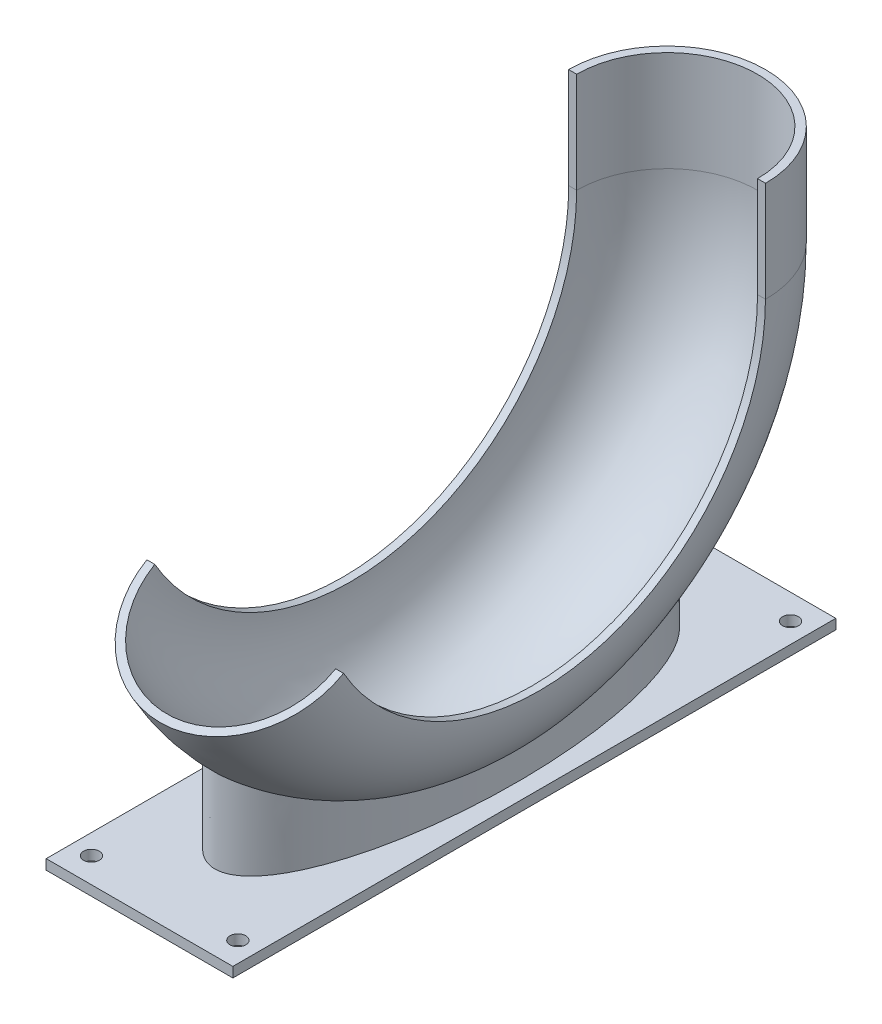
ISO-10303-21;
HEADER;
FILE_DESCRIPTION(('STEP AP214'),'2;1');
FILE_NAME('part.step','',(''),(''),'','','');
FILE_SCHEMA(('AUTOMOTIVE_DESIGN { 1 0 10303 214 1 1 1 1 }'));
ENDSEC;
DATA;
#1=APPLICATION_CONTEXT('core data for automotive mechanical design processes');
#2=APPLICATION_PROTOCOL_DEFINITION('international standard','automotive_design',2000,#1);
#3=PRODUCT_CONTEXT('',#1,'mechanical');
#4=PRODUCT('Part','Part','',(#3));
#5=PRODUCT_RELATED_PRODUCT_CATEGORY('part','',(#4));
#6=PRODUCT_DEFINITION_FORMATION('','',#4);
#7=PRODUCT_DEFINITION_CONTEXT('part definition',#1,'design');
#8=PRODUCT_DEFINITION('design','',#6,#7);
#9=PRODUCT_DEFINITION_SHAPE('','',#8);
#10=(LENGTH_UNIT() NAMED_UNIT(*) SI_UNIT(.MILLI.,.METRE.));
#11=(NAMED_UNIT(*) PLANE_ANGLE_UNIT() SI_UNIT($,.RADIAN.));
#12=(NAMED_UNIT(*) SI_UNIT($,.STERADIAN.) SOLID_ANGLE_UNIT());
#13=UNCERTAINTY_MEASURE_WITH_UNIT(LENGTH_MEASURE(1.E-05),#10,'distance_accuracy_value','');
#14=(GEOMETRIC_REPRESENTATION_CONTEXT(3) GLOBAL_UNCERTAINTY_ASSIGNED_CONTEXT((#13)) GLOBAL_UNIT_ASSIGNED_CONTEXT((#10,
#11,#12)) REPRESENTATION_CONTEXT('',''));
#15=CARTESIAN_POINT('',(0.,0.,0.));
#16=DIRECTION('',(0.,0.,1.));
#17=DIRECTION('',(1.,0.,0.));
#18=AXIS2_PLACEMENT_3D('',#15,#16,#17);
#19=CARTESIAN_POINT('',(0.,57.15,0.));
#20=DIRECTION('',(-1.,0.,0.));
#21=DIRECTION('',(0.,0.,1.));
#22=AXIS2_PLACEMENT_3D('',#19,#20,#21);
#23=TOROIDAL_SURFACE('',#22,57.15,24.86);
#24=CARTESIAN_POINT('',(24.86,57.15,0.));
#25=DIRECTION('',(-1.,0.,0.));
#26=DIRECTION('',(0.,0.,-1.));
#27=AXIS2_PLACEMENT_3D('',#24,#25,#26);
#28=CIRCLE('',#27,57.15);
#29=CARTESIAN_POINT('',(24.86,57.15,-57.15));
#30=VERTEX_POINT('',#29);
#31=CARTESIAN_POINT('',(24.86,28.5750000000003,49.4933518262809));
#32=VERTEX_POINT('',#31);
#33=EDGE_CURVE('E171',#30,#32,#28,.T.);
#34=ORIENTED_EDGE('',*,*,#33,.T.);
#35=CARTESIAN_POINT('',(0.,28.5750000000003,49.4933518262809));
#36=DIRECTION('',(0.,0.866025403784442,0.499999999999995));
#37=DIRECTION('',(1.,0.,0.));
#38=AXIS2_PLACEMENT_3D('',#35,#36,#37);
#39=CIRCLE('',#38,24.86);
#40=CARTESIAN_POINT('',(-24.86,28.5750000000003,49.4933518262809));
#41=VERTEX_POINT('',#40);
#42=EDGE_CURVE('E166',#41,#32,#39,.T.);
#43=ORIENTED_EDGE('',*,*,#42,.F.);
#44=CARTESIAN_POINT('',(-24.86,57.15,0.));
#45=DIRECTION('',(-1.,0.,0.));
#46=DIRECTION('',(0.,0.,-1.));
#47=AXIS2_PLACEMENT_3D('',#44,#45,#46);
#48=CIRCLE('',#47,57.15);
#49=CARTESIAN_POINT('',(-24.86,57.15,-57.15));
#50=VERTEX_POINT('',#49);
#51=EDGE_CURVE('E176',#50,#41,#48,.T.);
#52=ORIENTED_EDGE('',*,*,#51,.F.);
#53=CARTESIAN_POINT('',(0.,57.15,-57.15));
#54=DIRECTION('',(0.,-1.,0.));
#55=DIRECTION('',(1.,0.,0.));
#56=AXIS2_PLACEMENT_3D('',#53,#54,#55);
#57=CIRCLE('',#56,24.86);
#58=EDGE_CURVE('E148',#50,#30,#57,.T.);
#59=ORIENTED_EDGE('',*,*,#58,.T.);
#60=EDGE_LOOP('',(#34,#43,#52,#59));
#61=FACE_BOUND('',#60,.T.);
#62=CARTESIAN_POINT('',(0.,-1.66766401345772,57.15));
#63=CARTESIAN_POINT('',(-0.178848492996247,-1.66766454199373,57.1499992116019));
#64=CARTESIAN_POINT('',(-0.357703143540088,-1.67222600071906,57.1425284579619));
#65=CARTESIAN_POINT('',(-0.713726728572181,-1.69029072762417,57.1129102273241));
#66=CARTESIAN_POINT('',(-0.890895586579523,-1.70379439955008,57.0907620876338));
#67=CARTESIAN_POINT('',(-1.24228724068634,-1.73925621488908,57.0324966785866));
#68=CARTESIAN_POINT('',(-1.41650571125432,-1.76122580978427,56.9963604879065));
#69=CARTESIAN_POINT('',(-1.76058334092853,-1.81286516430904,56.9112198453707));
#70=CARTESIAN_POINT('',(-1.93044192838186,-1.84253592807919,56.8622137154186));
#71=CARTESIAN_POINT('',(-2.30935445547105,-1.91747503995724,56.7380745124606));
#72=CARTESIAN_POINT('',(-2.51686178400334,-1.96479310550471,56.6594592402112));
#73=CARTESIAN_POINT('',(-2.92285655427485,-2.06853997059414,56.4862983189966));
#74=CARTESIAN_POINT('',(-3.12133613940602,-2.12497651839542,56.3917391189725));
#75=CARTESIAN_POINT('',(-3.5092868827807,-2.24532663102402,56.1890346319803));
#76=CARTESIAN_POINT('',(-3.6987412322852,-2.30925343458834,56.0808652638758));
#77=CARTESIAN_POINT('',(-4.06843695057409,-2.44298663302802,55.8532669920397));
#78=CARTESIAN_POINT('',(-4.24868114212556,-2.51279120888075,55.7338415704181));
#79=CARTESIAN_POINT('',(-4.63519967451224,-2.67127828271343,55.4609992557792));
#80=CARTESIAN_POINT('',(-4.83960060812783,-2.76096948662821,55.3055226400686));
#81=CARTESIAN_POINT('',(-5.23711408042115,-2.94536447683028,54.9833002316253));
#82=CARTESIAN_POINT('',(-5.4302186060837,-3.04007173261331,54.8165466161666));
#83=CARTESIAN_POINT('',(-5.8060957453558,-3.23315021252265,54.4736927542222));
#84=CARTESIAN_POINT('',(-5.98886508174216,-3.33152258261191,54.2975895769908));
#85=CARTESIAN_POINT('',(-6.34532446564593,-3.53105946259726,53.9372071328339));
#86=CARTESIAN_POINT('',(-6.51899657666442,-3.63222892887993,53.7529129470627));
#87=CARTESIAN_POINT('',(-6.85771267580798,-3.83632706771237,53.3776839507408));
#88=CARTESIAN_POINT('',(-7.02276025346559,-3.93925498434131,53.1867519588434));
#89=CARTESIAN_POINT('',(-7.34507929889584,-4.14626666392499,52.7990873546648));
#90=CARTESIAN_POINT('',(-7.50235119925125,-4.25035036218495,52.6023550660447));
#91=CARTESIAN_POINT('',(-7.92118174357294,-4.53477764719471,52.0594822148204));
#92=CARTESIAN_POINT('',(-8.17579201920327,-4.71576688406498,51.7083075662338));
#93=CARTESIAN_POINT('',(-8.66700183032977,-5.07770627649855,50.9935942476309));
#94=CARTESIAN_POINT('',(-8.90359916248866,-5.25865642458977,50.6300540729108));
#95=CARTESIAN_POINT('',(-9.36075037473462,-5.61887527211132,49.8931140877776));
#96=CARTESIAN_POINT('',(-9.58132735077129,-5.7981460540035,49.519729573222));
#97=CARTESIAN_POINT('',(-10.0086848561781,-6.15429188914322,48.7639978832109));
#98=CARTESIAN_POINT('',(-10.2154639494059,-6.33116669148473,48.3816497803665));
#99=CARTESIAN_POINT('',(-10.587251408081,-6.65604121594503,47.6657969718773));
#100=CARTESIAN_POINT('',(-10.7539375597834,-6.80447051954047,47.3333551076422));
#101=CARTESIAN_POINT('',(-11.0790832561206,-7.09868004199863,46.6633090849058));
#102=CARTESIAN_POINT('',(-11.2375424681961,-7.2444601536179,46.3257047184326));
#103=CARTESIAN_POINT('',(-11.7016102336936,-7.67741713870339,45.3057635042271));
#104=CARTESIAN_POINT('',(-11.9958768514462,-7.96018230024556,44.6163609610707));
#105=CARTESIAN_POINT('',(-12.5584463393137,-8.51245397802807,43.221122941126));
#106=CARTESIAN_POINT('',(-12.826725969954,-8.78194852275139,42.5152734432971));
#107=CARTESIAN_POINT('',(-13.3400406710326,-9.30632761524536,41.0899128309377));
#108=CARTESIAN_POINT('',(-13.5850773307688,-9.56121316147144,40.3704026545347));
#109=CARTESIAN_POINT('',(-14.0535983092612,-10.0550038720308,38.9214196495707));
#110=CARTESIAN_POINT('',(-14.2771397896273,-10.2939508713863,38.1919794845824));
#111=CARTESIAN_POINT('',(-14.7052245597423,-10.7561977807733,36.7226463860196));
#112=CARTESIAN_POINT('',(-14.9097675867719,-10.9794974744161,35.9827533080603));
#113=CARTESIAN_POINT('',(-15.3011957251059,-11.4101199897453,34.4940898961341));
#114=CARTESIAN_POINT('',(-15.4880884844618,-11.6174497241396,33.7453235668099));
#115=CARTESIAN_POINT('',(-15.8454695495776,-12.0161620628193,32.2396911011265));
#116=CARTESIAN_POINT('',(-16.0159579425298,-12.2075447518655,31.482825007843));
#117=CARTESIAN_POINT('',(-16.3413724702058,-12.5742885464508,29.9624591983523));
#118=CARTESIAN_POINT('',(-16.4963088722672,-12.7496602153651,29.1989642251358));
#119=CARTESIAN_POINT('',(-16.7915300732545,-13.0846753484434,27.6657037295536));
#120=CARTESIAN_POINT('',(-16.9318141521606,-13.2443180396586,26.8959379010379));
#121=CARTESIAN_POINT('',(-17.3317047139908,-13.6999737889179,24.5783902892331));
#122=CARTESIAN_POINT('',(-17.5703577758538,-13.9727238856046,23.0223193995996));
#123=CARTESIAN_POINT('',(-17.9957153521242,-14.4584218159896,19.8948045695264));
#124=CARTESIAN_POINT('',(-18.1824449165322,-14.6713984872752,18.323368422025));
#125=CARTESIAN_POINT('',(-18.5070109066394,-15.0406658800455,15.1689143163945));
#126=CARTESIAN_POINT('',(-18.6448485597881,-15.1969580246184,13.5858966500423));
#127=CARTESIAN_POINT('',(-18.8736309974006,-15.455660897142,10.4125547218049));
#128=CARTESIAN_POINT('',(-18.9645876873864,-15.558085305056,8.82223241855312));
#129=CARTESIAN_POINT('',(-19.1009556144638,-15.7113734060408,5.63717378006652));
#130=CARTESIAN_POINT('',(-19.1463665073639,-15.7622367094626,4.04243741156576));
#131=CARTESIAN_POINT('',(-19.1922755192672,-15.8136567983408,0.851647624451846));
#132=CARTESIAN_POINT('',(-19.1927772517612,-15.8142176312457,-0.744405677863815));
#133=CARTESIAN_POINT('',(-19.1488839585887,-15.7650573085609,-3.9351340504986));
#134=CARTESIAN_POINT('',(-19.1044888428612,-15.7153360521075,-5.52980911804663));
#135=CARTESIAN_POINT('',(-18.9701719705509,-15.5643705796365,-8.71502841486653));
#136=CARTESIAN_POINT('',(-18.8802444711365,-15.4631198643899,-10.3055720976207));
#137=CARTESIAN_POINT('',(-18.6535829407047,-15.2068523691833,-13.4790042230832));
#138=CARTESIAN_POINT('',(-18.5168497367108,-15.0518365392139,-15.0618928005507));
#139=CARTESIAN_POINT('',(-18.1945269541103,-14.6851659239217,-18.2165964993304));
#140=CARTESIAN_POINT('',(-18.0089235474704,-14.4734951075471,-19.7884083569833));
#141=CARTESIAN_POINT('',(-17.5859817136604,-13.9905708285554,-22.9161185851811));
#142=CARTESIAN_POINT('',(-17.3486403606542,-13.719313996279,-24.4720160505386));
#143=CARTESIAN_POINT('',(-16.9507441938851,-13.2658700344011,-26.7899285949477));
#144=CARTESIAN_POINT('',(-16.8110766781152,-13.1069001116107,-27.5601703997124));
#145=CARTESIAN_POINT('',(-16.5171132111101,-12.7732304636608,-29.0944174356359));
#146=CARTESIAN_POINT('',(-16.3628179762702,-12.5985315088544,-29.8584229702289));
#147=CARTESIAN_POINT('',(-16.0388469757001,-12.233276528279,-31.3792359821021));
#148=CARTESIAN_POINT('',(-15.8691733603317,-12.0427227198016,-32.1360444494475));
#149=CARTESIAN_POINT('',(-15.5134884572883,-11.6456865035811,-33.6416104493916));
#150=CARTESIAN_POINT('',(-15.3274772314356,-11.4392041561126,-34.3903680124432));
#151=CARTESIAN_POINT('',(-14.9378419776514,-11.0102340446703,-35.8792625328428));
#152=CARTESIAN_POINT('',(-14.7342059717563,-10.7877354134423,-36.619393233476));
#153=CARTESIAN_POINT('',(-14.3080130413355,-10.3270761648411,-38.0892963840448));
#154=CARTESIAN_POINT('',(-14.0854557406073,-10.0889152360839,-38.8190686276917));
#155=CARTESIAN_POINT('',(-13.6194690472105,-9.59716785141629,-40.2673660319328));
#156=CARTESIAN_POINT('',(-13.3760235263274,-9.34356952067701,-40.9858819858333));
#157=CARTESIAN_POINT('',(-12.8661525222173,-8.82180736548068,-42.4093448327723));
#158=CARTESIAN_POINT('',(-12.5997283805227,-8.55364439167109,-43.1142925150151));
#159=CARTESIAN_POINT('',(-12.1158571937264,-8.0775628974423,-44.3214970752297));
#160=CARTESIAN_POINT('',(-11.9044376816514,-7.8727751944728,-44.82740978703));
#161=CARTESIAN_POINT('',(-11.4661546757256,-7.45654950916877,-45.8298266637003));
#162=CARTESIAN_POINT('',(-11.2392895099641,-7.24511080823564,-46.3263298025739));
#163=CARTESIAN_POINT('',(-10.7681541749241,-6.81632499263647,-47.3087628151123));
#164=CARTESIAN_POINT('',(-10.5238757682865,-6.59897511215113,-47.7946875408497));
#165=CARTESIAN_POINT('',(-10.0153494338106,-6.15935848636814,-48.7544999713334));
#166=CARTESIAN_POINT('',(-9.75108200060868,-5.93708709216571,-49.2283752998809));
#167=CARTESIAN_POINT('',(-9.3375765677821,-5.60143721567509,-49.9278588731856));
#168=CARTESIAN_POINT('',(-9.19691037531257,-5.48919506665562,-50.1591020971772));
#169=CARTESIAN_POINT('',(-8.90936977686869,-5.26422536309683,-50.6174490521814));
#170=CARTESIAN_POINT('',(-8.76249568832876,-5.15149783364103,-50.844552994004));
#171=CARTESIAN_POINT('',(-8.46209111120894,-4.92595912159254,-51.2940057475721));
#172=CARTESIAN_POINT('',(-8.30856543827043,-4.81314805577244,-51.5163578310209));
#173=CARTESIAN_POINT('',(-7.994130338046,-4.5877728950142,-51.9558883540252));
#174=CARTESIAN_POINT('',(-7.83322150044955,-4.47520878110198,-52.1730672046664));
#175=CARTESIAN_POINT('',(-7.50202630951432,-4.24997569093824,-52.6031744688897));
#176=CARTESIAN_POINT('',(-7.33167855866189,-4.13731228665977,-52.8160586613402));
#177=CARTESIAN_POINT('',(-6.98182695891139,-3.9133717799365,-53.2349858343503));
#178=CARTESIAN_POINT('',(-6.80232228436231,-3.80209480363108,-53.4410281952283));
#179=CARTESIAN_POINT('',(-6.43303586214994,-3.58169392163964,-53.845215786981));
#180=CARTESIAN_POINT('',(-6.24324750990621,-3.47257146253808,-54.0433557974053));
#181=CARTESIAN_POINT('',(-5.85342741390424,-3.25822604210502,-54.4290035162927));
#182=CARTESIAN_POINT('',(-5.65345854017554,-3.15298476212344,-54.6165642490601));
#183=CARTESIAN_POINT('',(-5.24116726435038,-2.94720513617125,-54.9801764850313));
#184=CARTESIAN_POINT('',(-5.02885109596688,-2.84666446249617,-55.1562337022335));
#185=CARTESIAN_POINT('',(-4.5906837597335,-2.65214301294522,-55.4941819970264));
#186=CARTESIAN_POINT('',(-4.36484885172046,-2.55815463957724,-55.6560895385723));
#187=CARTESIAN_POINT('',(-3.98312750743247,-2.41158739926033,-55.9067992470817));
#188=CARTESIAN_POINT('',(-3.8316497303757,-2.35637360203447,-56.0007844453441));
#189=CARTESIAN_POINT('',(-3.52244964401377,-2.25028551539733,-56.1806178482274));
#190=CARTESIAN_POINT('',(-3.36472777955307,-2.19941091766226,-56.2664666310334));
#191=CARTESIAN_POINT('',(-3.04291362653003,-2.10285013160159,-56.4288045828752));
#192=CARTESIAN_POINT('',(-2.87881961934888,-2.05716535623922,-56.505291203438));
#193=CARTESIAN_POINT('',(-2.54442910954423,-1.9719650824322,-56.6474804538514));
#194=CARTESIAN_POINT('',(-2.37413246150146,-1.93244972874297,-56.713182830669));
#195=CARTESIAN_POINT('',(-2.02548092666296,-1.86014062097355,-56.8330989264688));
#196=CARTESIAN_POINT('',(-1.84704912851576,-1.82744294748584,-56.8871487462481));
#197=CARTESIAN_POINT('',(-1.48514921406938,-1.77049280342599,-56.9811050533313));
#198=CARTESIAN_POINT('',(-1.30168131268732,-1.74623997307042,-57.0210121431722));
#199=CARTESIAN_POINT('',(-0.931345564623859,-1.70712326292789,-57.085300245974));
#200=CARTESIAN_POINT('',(-0.744483854286833,-1.69224389480241,-57.1097068718351));
#201=CARTESIAN_POINT('',(-0.368821708550303,-1.67243926588055,-57.1421797334333));
#202=CARTESIAN_POINT('',(-0.180021551260178,-1.66751259668413,-57.1502482811618));
#203=CARTESIAN_POINT('',(0.175375037472764,-1.66780449506217,-57.1497696586221));
#204=CARTESIAN_POINT('',(0.341978527999268,-1.67190094333084,-57.1430602824974));
#205=CARTESIAN_POINT('',(0.673785100018587,-1.6878643973035,-57.116889282399));
#206=CARTESIAN_POINT('',(0.838988312406551,-1.6997306684017,-57.0974288639855));
#207=CARTESIAN_POINT('',(1.16691524221668,-1.73085575784859,-57.0463057114767));
#208=CARTESIAN_POINT('',(1.32963674792725,-1.75012081062954,-57.0146326865881));
#209=CARTESIAN_POINT('',(1.6514779284684,-1.79545917791311,-56.9399374043604));
#210=CARTESIAN_POINT('',(1.81059704737282,-1.82153353556031,-56.8969134081104));
#211=CARTESIAN_POINT('',(2.17213745865251,-1.88864109608779,-56.7858947730082));
#212=CARTESIAN_POINT('',(2.37305613447687,-1.931812735004,-56.7142843255156));
#213=CARTESIAN_POINT('',(2.76660108698988,-2.02691932961269,-56.555863062327));
#214=CARTESIAN_POINT('',(2.95922450371388,-2.07885727779061,-56.4690470556471));
#215=CARTESIAN_POINT('',(3.52489221600959,-2.24566316819816,-56.1888580034658));
#216=CARTESIAN_POINT('',(3.88516312954303,-2.37140893744474,-55.9759310452963));
#217=CARTESIAN_POINT('',(4.43196512072702,-2.58611321043711,-55.6079198217304));
#218=CARTESIAN_POINT('',(4.62934550679482,-2.66911353801462,-55.4647424573683));
#219=CARTESIAN_POINT('',(5.01373302329529,-2.84015835795796,-55.1674902965457));
#220=CARTESIAN_POINT('',(5.2007329440338,-2.92820627191064,-55.0134080910671));
#221=CARTESIAN_POINT('',(5.5650620837994,-3.10803748807468,-54.6962231234377));
#222=CARTESIAN_POINT('',(5.74238834570585,-3.19982191768653,-54.533117633327));
#223=CARTESIAN_POINT('',(6.08853636075367,-3.38631559460669,-54.1989740131481));
#224=CARTESIAN_POINT('',(6.25734069602548,-3.48103024085922,-54.0279209079452));
#225=CARTESIAN_POINT('',(6.58679921600103,-3.6723928556851,-53.6793549735694));
#226=CARTESIAN_POINT('',(6.74745667482546,-3.76904002547704,-53.5018447894633));
#227=CARTESIAN_POINT('',(7.06140038758813,-3.9636831659995,-53.141180239481));
#228=CARTESIAN_POINT('',(7.21468702559904,-4.06167906610851,-52.9580261685095));
#229=CARTESIAN_POINT('',(7.62129442773059,-4.32859615653338,-52.4546082123158));
#230=CARTESIAN_POINT('',(7.86814985714536,-4.49834822870013,-52.1295520528186));
#231=CARTESIAN_POINT('',(8.34490244464788,-4.83847036967429,-51.4675815256951));
#232=CARTESIAN_POINT('',(8.57479763535071,-5.00884050777983,-51.1306657890348));
#233=CARTESIAN_POINT('',(9.01943128882524,-5.34861379408192,-50.4473729842979));
#234=CARTESIAN_POINT('',(9.23419177778378,-5.518018003363,-50.1010107276464));
#235=CARTESIAN_POINT('',(9.65067253862039,-5.85515535315964,-49.3997077266613));
#236=CARTESIAN_POINT('',(9.85239141501111,-6.0228883132281,-49.0447660698733));
#237=CARTESIAN_POINT('',(10.2173141798932,-6.33311496864393,-48.3765577511937));
#238=CARTESIAN_POINT('',(10.3820080692394,-6.47591765638406,-48.0642451429745));
#239=CARTESIAN_POINT('',(10.7034461855032,-6.75936471227439,-47.4345829511567));
#240=CARTESIAN_POINT('',(10.8601900756501,-6.90000898881619,-47.1172331549237));
#241=CARTESIAN_POINT('',(11.3195083405231,-7.31828494226217,-46.1582399173094));
#242=CARTESIAN_POINT('',(11.6111355025805,-7.59223064528053,-45.5097152196383));
#243=CARTESIAN_POINT('',(12.1694189818831,-8.12875284495887,-44.1966776230494));
#244=CARTESIAN_POINT('',(12.4360517651451,-8.39131850391163,-43.5321503819101));
#245=CARTESIAN_POINT('',(12.9470103288634,-8.90367104439499,-42.18981261636));
#246=CARTESIAN_POINT('',(13.1913377107319,-9.15345884274269,-41.5120030498018));
#247=CARTESIAN_POINT('',(13.6593262844303,-9.63881418483811,-40.1466863562905));
#248=CARTESIAN_POINT('',(13.8830441708344,-9.87442008165165,-39.4592122185473));
#249=CARTESIAN_POINT('',(14.3123692306954,-10.3316876187822,-38.0740522872478));
#250=CARTESIAN_POINT('',(14.5179761556806,-10.5533490677777,-37.3763663537449));
#251=CARTESIAN_POINT('',(14.9123884708512,-10.9823123430396,-35.9723230919266));
#252=CARTESIAN_POINT('',(15.1012024281816,-11.1896214792189,-35.2659703968156));
#253=CARTESIAN_POINT('',(15.4632890339714,-11.5898524593845,-33.8452651478194));
#254=CARTESIAN_POINT('',(15.6365617269324,-11.7827743445677,-33.1309126168477));
#255=CARTESIAN_POINT('',(15.9683932557395,-12.1540702517767,-31.6955981989215));
#256=CARTESIAN_POINT('',(16.1269621099678,-12.332454168983,-30.9746411854165));
#257=CARTESIAN_POINT('',(16.4302869178928,-12.6748785430268,-29.5264766066545));
#258=CARTESIAN_POINT('',(16.5750430029573,-12.8389191362766,-28.7992691009152));
#259=CARTESIAN_POINT('',(16.9896835097847,-13.3098098731352,-26.608936940803));
#260=CARTESIAN_POINT('',(17.2398709183881,-13.5953509076146,-25.1374054066555));
#261=CARTESIAN_POINT('',(17.6770307127354,-14.0945005277779,-22.273928625543));
#262=CARTESIAN_POINT('',(17.8670590694599,-14.3115828900634,-20.8830422238959));
#263=CARTESIAN_POINT('',(18.2071949509706,-14.6995623301725,-18.0898064103665));
#264=CARTESIAN_POINT('',(18.3572967795312,-14.8704528179641,-16.6874553922388));
#265=CARTESIAN_POINT('',(18.6193695027724,-15.1680962536034,-13.8743153980601));
#266=CARTESIAN_POINT('',(18.7313333494586,-15.2948410433131,-12.4635249113394));
#267=CARTESIAN_POINT('',(18.9183719786268,-15.5060674599244,-9.63652323726373));
#268=CARTESIAN_POINT('',(18.9934506451164,-15.5905535366831,-8.22031263648028));
#269=CARTESIAN_POINT('',(19.1073652511067,-15.7185444764176,-5.38994251371316));
#270=CARTESIAN_POINT('',(19.146336200703,-15.7622020068879,-3.97579525306422));
#271=CARTESIAN_POINT('',(19.1889393688401,-15.8099209603022,-1.1469098173224));
#272=CARTESIAN_POINT('',(19.1925866325116,-15.8139992409161,0.267827849513776));
#273=CARTESIAN_POINT('',(19.1646214800722,-15.7826856817361,3.09652082004179));
#274=CARTESIAN_POINT('',(19.1330090706887,-15.747293849473,4.51047612388286));
#275=CARTESIAN_POINT('',(19.0341558531497,-15.6363192452366,7.33620798925882));
#276=CARTESIAN_POINT('',(18.9668993000718,-15.5607187120076,8.7479833112314));
#277=CARTESIAN_POINT('',(18.799520784329,-15.3719170227701,11.5084385054588));
#278=CARTESIAN_POINT('',(18.7008669783614,-15.2603932688743,12.8573215924674));
#279=CARTESIAN_POINT('',(18.4690671208224,-14.9975012842868,15.548392203851));
#280=CARTESIAN_POINT('',(18.3359176793749,-14.8461291376816,16.8905790569694));
#281=CARTESIAN_POINT('',(18.0337421239792,-14.5018064274786,19.5651308909501));
#282=CARTESIAN_POINT('',(17.8647280027482,-14.3088697622276,20.8974990013617));
#283=CARTESIAN_POINT('',(17.4888949684183,-13.8796786925395,23.5496969744708));
#284=CARTESIAN_POINT('',(17.2820815619184,-13.6434305976949,24.8695286340548));
#285=CARTESIAN_POINT('',(16.828652429123,-13.1267701063315,27.4901069980682));
#286=CARTESIAN_POINT('',(16.5821408033119,-12.8464732638797,28.790894166525));
#287=CARTESIAN_POINT('',(16.1796876987375,-12.3919091533884,30.7272293421323));
#288=CARTESIAN_POINT('',(16.0400780372374,-12.2346889985851,31.3702450312905));
#289=CARTESIAN_POINT('',(15.7494082149505,-11.9088300757606,32.6507628164863));
#290=CARTESIAN_POINT('',(15.5983485045431,-11.7401917568927,33.2882651282908));
#291=CARTESIAN_POINT('',(15.2840132542474,-11.3913491810098,34.5576899329052));
#292=CARTESIAN_POINT('',(15.1207273064299,-11.2111350887721,35.1896071477332));
#293=CARTESIAN_POINT('',(14.7813064538512,-10.8393556618074,36.4465897751676));
#294=CARTESIAN_POINT('',(14.6051721491787,-10.6477908572994,37.0716555062094));
#295=CARTESIAN_POINT('',(14.2392506273269,-10.2535797918435,38.3138251672517));
#296=CARTESIAN_POINT('',(14.0494714252252,-10.0509400528764,38.9309335242136));
#297=CARTESIAN_POINT('',(13.6550781345667,-9.63474706829479,40.1566673113486));
#298=CARTESIAN_POINT('',(13.4504645429115,-9.42119418830385,40.7652930248479));
#299=CARTESIAN_POINT('',(13.0816304298857,-9.04178903934514,41.8123926279952));
#300=CARTESIAN_POINT('',(12.9211430475967,-8.87835860980241,42.2530628550405));
#301=CARTESIAN_POINT('',(12.5907941068079,-8.54606157518389,43.1288003812519));
#302=CARTESIAN_POINT('',(12.4209327806388,-8.37719510488205,43.5638678189521));
#303=CARTESIAN_POINT('',(12.0707514474301,-8.03400138517006,44.4286323891575));
#304=CARTESIAN_POINT('',(11.8904132066276,-7.85966487394418,44.8583184747268));
#305=CARTESIAN_POINT('',(11.5186387071838,-7.50620408796275,45.7108411227982));
#306=CARTESIAN_POINT('',(11.3272031608738,-7.32708012090886,46.133678122716));
#307=CARTESIAN_POINT('',(10.9408265044942,-6.9725310435114,46.953217636649));
#308=CARTESIAN_POINT('',(10.7464139605618,-6.797292164151,47.3502494304731));
#309=CARTESIAN_POINT('',(10.3451855214921,-6.44340966007577,48.1365384116908));
#310=CARTESIAN_POINT('',(10.1383681725286,-6.26476563796319,48.525794680649));
#311=CARTESIAN_POINT('',(9.71078069021117,-5.90474495293957,49.2955627022371));
#312=CARTESIAN_POINT('',(9.4900044743998,-5.72336712538073,49.6760705429575));
#313=CARTESIAN_POINT('',(9.03344735703704,-5.35949857908653,50.4255831661648));
#314=CARTESIAN_POINT('',(8.7977150618306,-5.17701304927757,50.7946199347858));
#315=CARTESIAN_POINT('',(8.30843195860317,-4.81177619384166,51.5203832747259));
#316=CARTESIAN_POINT('',(8.05488733013433,-4.62902498172408,51.877114051892));
#317=CARTESIAN_POINT('',(7.52718342263684,-4.26517266956724,52.5755430194347));
#318=CARTESIAN_POINT('',(7.25303998787352,-4.08407041899518,52.9172524497005));
#319=CARTESIAN_POINT('',(6.80298761475731,-3.80281361582112,53.4396222790292));
#320=CARTESIAN_POINT('',(6.63528562355495,-3.70120619636749,53.6265845283215));
#321=CARTESIAN_POINT('',(6.29105269775731,-3.500099383066,53.9934125249966));
#322=CARTESIAN_POINT('',(6.11452193756575,-3.40059994763221,54.1732784124358));
#323=CARTESIAN_POINT('',(5.75128859087339,-3.20435888338311,54.5250814662059));
#324=CARTESIAN_POINT('',(5.56456284881713,-3.10762436324809,54.6969987936561));
#325=CARTESIAN_POINT('',(5.18031247386847,-2.91830283305419,55.0308261108084));
#326=CARTESIAN_POINT('',(4.98278781315825,-2.82571583368037,55.1927360747294));
#327=CARTESIAN_POINT('',(4.57283805085761,-2.64480817871247,55.5067983611391));
#328=CARTESIAN_POINT('',(4.3602333763639,-2.55657275091306,55.6587670582651));
#329=CARTESIAN_POINT('',(3.92177894356065,-2.38784957708579,55.9474310553189));
#330=CARTESIAN_POINT('',(3.69592600264669,-2.3073637050856,56.0841226621597));
#331=CARTESIAN_POINT('',(3.23136076826444,-2.15698103842747,56.338055546547));
#332=CARTESIAN_POINT('',(2.99270461066096,-2.08704244089728,56.4553737938461));
#333=CARTESIAN_POINT('',(2.50199895314544,-1.96041223940229,56.6668093615161));
#334=CARTESIAN_POINT('',(2.24996249821112,-1.90370801361946,56.760948792619));
#335=CARTESIAN_POINT('',(1.83258899726008,-1.82527664408624,56.8907320836634));
#336=CARTESIAN_POINT('',(1.67085715425537,-1.79845853153347,56.9349908561928));
#337=CARTESIAN_POINT('',(1.34363127228259,-1.75184925530903,57.0117896728951));
#338=CARTESIAN_POINT('',(1.17813794801431,-1.73205676841574,57.0443319237995));
#339=CARTESIAN_POINT('',(0.844592426332503,-1.70013360491855,57.0967681116434));
#340=CARTESIAN_POINT('',(0.676543083375939,-1.68799494409319,57.1166752292852));
#341=CARTESIAN_POINT('',(0.338997722939548,-1.67175967799708,57.1432919079462));
#342=CARTESIAN_POINT('',(0.169501626850637,-1.66766351254372,57.1500007471953));
#343=CARTESIAN_POINT('',(0.,-1.66766401345772,57.15));
#344=B_SPLINE_CURVE_WITH_KNOTS('',3,(#62,#63,#64,#65,#66,#67,#68,#69,#70,#71,#72,#73,#74,#75,
#76,#77,#78,#79,#80,#81,#82,#83,#84,#85,#86,#87,#88,#89,#90,#91,#92,#93,#94,#95,#96,#97,#98,#99,
#100,#101,#102,#103,#104,#105,#106,#107,#108,#109,#110,#111,#112,#113,#114,#115,#116,#117,#118,
#119,#120,#121,#122,#123,#124,#125,#126,#127,#128,#129,#130,#131,#132,#133,#134,#135,#136,#137,
#138,#139,#140,#141,#142,#143,#144,#145,#146,#147,#148,#149,#150,#151,#152,#153,#154,#155,#156,
#157,#158,#159,#160,#161,#162,#163,#164,#165,#166,#167,#168,#169,#170,#171,#172,#173,#174,#175,
#176,#177,#178,#179,#180,#181,#182,#183,#184,#185,#186,#187,#188,#189,#190,#191,#192,#193,#194,
#195,#196,#197,#198,#199,#200,#201,#202,#203,#204,#205,#206,#207,#208,#209,#210,#211,#212,#213,
#214,#215,#216,#217,#218,#219,#220,#221,#222,#223,#224,#225,#226,#227,#228,#229,#230,#231,#232,
#233,#234,#235,#236,#237,#238,#239,#240,#241,#242,#243,#244,#245,#246,#247,#248,#249,#250,#251,
#252,#253,#254,#255,#256,#257,#258,#259,#260,#261,#262,#263,#264,#265,#266,#267,#268,#269,#270,
#271,#272,#273,#274,#275,#276,#277,#278,#279,#280,#281,#282,#283,#284,#285,#286,#287,#288,#289,
#290,#291,#292,#293,#294,#295,#296,#297,#298,#299,#300,#301,#302,#303,#304,#305,#306,#307,#308,
#309,#310,#311,#312,#313,#314,#315,#316,#317,#318,#319,#320,#321,#322,#323,#324,#325,#326,#327,
#328,#329,#330,#331,#332,#333,#334,#335,#336,#337,#338,#339,#340,#341,#342,#343),.UNSPECIFIED.,
.T.,.F.,(4,2,2,2,2,2,2,2,2,2,2,2,2,2,2,2,2,2,2,2,2,2,2,2,2,2,2,2,2,2,2,2,2,2,2,2,2,2,2,2,2,2,2,
2,2,2,2,2,2,2,2,2,2,2,2,2,2,2,2,2,2,2,2,2,2,2,2,2,2,2,2,2,2,2,2,2,2,2,2,2,2,2,2,2,2,2,2,2,2,2,2,
2,2,2,2,2,2,2,2,2,2,2,2,2,2,2,2,2,2,2,2,2,2,2,2,2,2,2,2,2,2,2,2,2,2,2,2,2,2,2,2,2,2,2,2,2,2,2,2,
2,4),(0.,0.536346343730882,1.07271690546271,1.60981555338478,2.14698426777668,2.82655614918274,
3.50670855071589,4.18808176329738,4.86924487761334,5.68469170508218,6.50071011903559,
7.3169858527903,8.13481468617054,8.95230038271433,9.76974054894031,11.179098865957,
12.5886292991631,13.9960855792234,15.4036881255546,16.6048021275583,17.8059646447129,
20.2085165072322,22.6131974476234,25.0177138430754,27.4156480702253,29.8136154521839,
32.2105389552168,34.6074497174388,37.0027674983446,39.3982029306063,44.1889511724276,
48.9773841371576,53.765696877991,58.5527930165538,63.3399253311146,68.1266724620255,
72.9134291949515,77.7007898143005,82.4880658487523,87.2766979218697,92.0656008675221,
94.4616868205686,96.8576554854265,99.2532896369027,101.648914723587,104.046180879049,
106.443494709273,108.842676503853,111.241718324677,112.997363398991,114.75319881571,
116.509870416597,118.268278864558,119.147251430595,120.026179105515,120.90448074996,
121.782712366609,122.667545515044,123.552458587608,124.437946882183,125.318508297446,
126.198628944038,127.077711492942,127.637295545853,128.196839804081,128.756536038646,
129.316245403599,129.883376823911,130.450484079243,131.016651793988,131.582739385087,
132.082433056451,132.582079490589,133.082147868612,133.582292899088,134.234119289502,
134.886168640413,136.192079847318,136.96448088892,137.737411852378,138.510577782546,
139.285264816584,140.059638005907,140.833970801007,142.1595099366,143.485202593529,
144.808924268858,146.132787352313,147.275242422077,148.417745847155,150.702983032948,
152.990350762125,155.277554140805,157.558265036507,159.83900721734,162.118579093267,
164.398144441576,166.676145028975,168.954123949078,173.511041282894,177.771159041067,
182.031884254824,186.293396434612,190.554459781161,194.799525549826,199.042783172556,
203.286039985674,207.531172717113,211.601412848453,215.672053112932,219.741334343276,
223.810023232661,227.868211533208,229.897592384871,231.926893453673,233.95794210439,
235.988895954655,238.018666409011,240.048368904369,241.538168861301,243.027931910522,
244.520370253418,246.012712903184,247.439121474437,248.865697546731,250.292899579611,
251.71567988729,253.137969010779,254.559175116437,255.371765364703,256.184339567377,
256.998843042797,257.813348616462,258.640118057027,259.467086930676,260.290686830248,
261.113498010954,261.622413935168,262.131233958129,262.639522314673,263.147838467047),.UNSPECIFIED.);
#345=CARTESIAN_POINT('',(0.,-1.66766401345772,57.15));
#346=VERTEX_POINT('',#345);
#347=EDGE_CURVE('E163',#346,#346,#344,.T.);
#348=ORIENTED_EDGE('',*,*,#347,.F.);
#349=EDGE_LOOP('',(#348));
#350=FACE_BOUND('',#349,.T.);
#351=ADVANCED_FACE('F42',(#61,#350),#23,.T.);
#352=CARTESIAN_POINT('',(0.,28.5750000000003,49.4933518262809));
#353=DIRECTION('',(0.,0.866025403784442,0.499999999999995));
#354=DIRECTION('',(1.,0.,0.));
#355=AXIS2_PLACEMENT_3D('',#352,#353,#354);
#356=PLANE('',#355);
#357=CARTESIAN_POINT('',(0.,28.5750000000003,49.4933518262809));
#358=DIRECTION('',(0.,-0.866025403784442,-0.499999999999995));
#359=DIRECTION('',(1.,0.,0.));
#360=AXIS2_PLACEMENT_3D('',#357,#358,#359);
#361=CIRCLE('',#360,22.86);
#362=CARTESIAN_POINT('',(22.86,28.5750000000003,49.4933518262809));
#363=VERTEX_POINT('',#362);
#364=CARTESIAN_POINT('',(-22.86,28.5750000000003,49.4933518262809));
#365=VERTEX_POINT('',#364);
#366=EDGE_CURVE('E187',#363,#365,#361,.T.);
#367=ORIENTED_EDGE('',*,*,#366,.T.);
#368=DIRECTION('',(-1.,0.,0.));
#369=VECTOR('',#368,1.);
#370=CARTESIAN_POINT('',(-22.86,28.5750000000003,49.4933518262809));
#371=LINE('',#370,#369);
#372=EDGE_CURVE('E196',#365,#41,#371,.T.);
#373=ORIENTED_EDGE('',*,*,#372,.T.);
#374=ORIENTED_EDGE('',*,*,#42,.T.);
#375=DIRECTION('',(-1.,0.,0.));
#376=VECTOR('',#375,1.);
#377=CARTESIAN_POINT('',(22.86,28.5750000000003,49.4933518262809));
#378=LINE('',#377,#376);
#379=EDGE_CURVE('E169',#32,#363,#378,.T.);
#380=ORIENTED_EDGE('',*,*,#379,.T.);
#381=EDGE_LOOP('',(#367,#373,#374,#380));
#382=FACE_BOUND('',#381,.T.);
#383=ADVANCED_FACE('F44',(#382),#356,.T.);
#384=CARTESIAN_POINT('',(0.,57.15,0.));
#385=DIRECTION('',(-1.,0.,0.));
#386=DIRECTION('',(0.,0.,1.));
#387=AXIS2_PLACEMENT_3D('',#384,#385,#386);
#388=CYLINDRICAL_SURFACE('',#387,57.15);
#389=CARTESIAN_POINT('',(22.86,57.15,0.));
#390=DIRECTION('',(-1.,0.,0.));
#391=DIRECTION('',(0.,0.,-1.));
#392=AXIS2_PLACEMENT_3D('',#389,#390,#391);
#393=CIRCLE('',#392,57.15);
#394=CARTESIAN_POINT('',(22.86,57.15,-57.15));
#395=VERTEX_POINT('',#394);
#396=EDGE_CURVE('E175',#395,#363,#393,.T.);
#397=ORIENTED_EDGE('',*,*,#396,.T.);
#398=ORIENTED_EDGE('',*,*,#379,.F.);
#399=ORIENTED_EDGE('',*,*,#33,.F.);
#400=DIRECTION('',(-1.,0.,0.));
#401=VECTOR('',#400,1.);
#402=CARTESIAN_POINT('',(22.86,57.15,-57.15));
#403=LINE('',#402,#401);
#404=EDGE_CURVE('E153',#30,#395,#403,.T.);
#405=ORIENTED_EDGE('',*,*,#404,.T.);
#406=EDGE_LOOP('',(#397,#398,#399,#405));
#407=FACE_BOUND('',#406,.T.);
#408=ADVANCED_FACE('F274',(#407),#388,.F.);
#409=CARTESIAN_POINT('',(0.,57.15,0.));
#410=DIRECTION('',(-1.,0.,0.));
#411=DIRECTION('',(0.,0.,1.));
#412=AXIS2_PLACEMENT_3D('',#409,#410,#411);
#413=TOROIDAL_SURFACE('',#412,57.15,22.86);
#414=CARTESIAN_POINT('',(0.,-22.86,0.));
#415=VERTEX_POINT('',#414);
#416=VERTEX_LOOP('',#415);
#417=FACE_BOUND('',#416,.T.);
#418=CARTESIAN_POINT('',(-22.86,57.15,0.));
#419=DIRECTION('',(-1.,0.,0.));
#420=DIRECTION('',(0.,0.,-1.));
#421=AXIS2_PLACEMENT_3D('',#418,#419,#420);
#422=CIRCLE('',#421,57.15);
#423=CARTESIAN_POINT('',(-22.86,57.15,-57.15));
#424=VERTEX_POINT('',#423);
#425=EDGE_CURVE('E170',#424,#365,#422,.T.);
#426=ORIENTED_EDGE('',*,*,#425,.T.);
#427=ORIENTED_EDGE('',*,*,#366,.F.);
#428=ORIENTED_EDGE('',*,*,#396,.F.);
#429=CARTESIAN_POINT('',(0.,57.15,-57.15));
#430=DIRECTION('',(0.,1.,0.));
#431=DIRECTION('',(1.,0.,0.));
#432=AXIS2_PLACEMENT_3D('',#429,#430,#431);
#433=CIRCLE('',#432,22.86);
#434=EDGE_CURVE('E184',#395,#424,#433,.T.);
#435=ORIENTED_EDGE('',*,*,#434,.T.);
#436=EDGE_LOOP('',(#426,#427,#428,#435));
#437=FACE_BOUND('',#436,.T.);
#438=ADVANCED_FACE('F277',(#417,#437),#413,.F.);
#439=CARTESIAN_POINT('',(0.,57.15,0.));
#440=DIRECTION('',(-1.,0.,0.));
#441=DIRECTION('',(0.,0.,1.));
#442=AXIS2_PLACEMENT_3D('',#439,#440,#441);
#443=CYLINDRICAL_SURFACE('',#442,57.15);
#444=ORIENTED_EDGE('',*,*,#372,.F.);
#445=ORIENTED_EDGE('',*,*,#425,.F.);
#446=DIRECTION('',(-1.,0.,0.));
#447=VECTOR('',#446,1.);
#448=CARTESIAN_POINT('',(-22.86,57.15,-57.15));
#449=LINE('',#448,#447);
#450=EDGE_CURVE('E180',#424,#50,#449,.T.);
#451=ORIENTED_EDGE('',*,*,#450,.T.);
#452=ORIENTED_EDGE('',*,*,#51,.T.);
#453=EDGE_LOOP('',(#444,#445,#451,#452));
#454=FACE_BOUND('',#453,.T.);
#455=ADVANCED_FACE('F260',(#454),#443,.F.);
#456=CARTESIAN_POINT('',(0.,139.161,0.));
#457=DIRECTION('',(0.,1.,0.));
#458=DIRECTION('',(0.,0.,1.));
#459=AXIS2_PLACEMENT_3D('',#456,#457,#458);
#460=ELLIPSE('',#459,57.15,19.1869174594889);
#461=DIRECTION('',(0.,-1.,0.));
#462=VECTOR('',#461,1.);
#463=SURFACE_OF_LINEAR_EXTRUSION('',#460,#462);
#464=ORIENTED_EDGE('',*,*,#347,.T.);
#465=EDGE_LOOP('',(#464));
#466=FACE_BOUND('',#465,.T.);
#467=CARTESIAN_POINT('',(0.,-22.86,0.));
#468=DIRECTION('',(0.,1.,0.));
#469=DIRECTION('',(0.,0.,1.));
#470=AXIS2_PLACEMENT_3D('',#467,#468,#469);
#471=ELLIPSE('',#470,57.15,19.1869174594889);
#472=CARTESIAN_POINT('',(0.,-22.86,57.15));
#473=VERTEX_POINT('',#472);
#474=EDGE_CURVE('E238',#473,#473,#471,.T.);
#475=ORIENTED_EDGE('',*,*,#474,.T.);
#476=EDGE_LOOP('',(#475));
#477=FACE_BOUND('',#476,.T.);
#478=ADVANCED_FACE('F256',(#466,#477),#463,.F.);
#479=CARTESIAN_POINT('',(0.,-25.4,0.));
#480=DIRECTION('',(0.,1.,0.));
#481=DIRECTION('',(0.,0.,1.));
#482=AXIS2_PLACEMENT_3D('',#479,#480,#481);
#483=PLANE('',#482);
#484=CARTESIAN_POINT('',(-18.51,-25.4,-69.85));
#485=DIRECTION('',(0.,1.,0.));
#486=DIRECTION('',(0.,0.,1.));
#487=AXIS2_PLACEMENT_3D('',#484,#485,#486);
#488=CIRCLE('',#487,2.);
#489=CARTESIAN_POINT('',(-18.51,-25.4,-67.85));
#490=VERTEX_POINT('',#489);
#491=EDGE_CURVE('E330',#490,#490,#488,.T.);
#492=ORIENTED_EDGE('',*,*,#491,.T.);
#493=EDGE_LOOP('',(#492));
#494=FACE_BOUND('',#493,.T.);
#495=CARTESIAN_POINT('',(18.51,-25.4,-69.85));
#496=DIRECTION('',(0.,1.,0.));
#497=DIRECTION('',(0.,0.,1.));
#498=AXIS2_PLACEMENT_3D('',#495,#496,#497);
#499=CIRCLE('',#498,2.);
#500=CARTESIAN_POINT('',(18.51,-25.4,-67.85));
#501=VERTEX_POINT('',#500);
#502=EDGE_CURVE('E354',#501,#501,#499,.T.);
#503=ORIENTED_EDGE('',*,*,#502,.T.);
#504=EDGE_LOOP('',(#503));
#505=FACE_BOUND('',#504,.T.);
#506=CARTESIAN_POINT('',(18.51,-25.4,69.85));
#507=DIRECTION('',(0.,1.,0.));
#508=DIRECTION('',(0.,0.,1.));
#509=AXIS2_PLACEMENT_3D('',#506,#507,#508);
#510=CIRCLE('',#509,2.);
#511=CARTESIAN_POINT('',(18.51,-25.4,71.85));
#512=VERTEX_POINT('',#511);
#513=EDGE_CURVE('E358',#512,#512,#510,.T.);
#514=ORIENTED_EDGE('',*,*,#513,.T.);
#515=EDGE_LOOP('',(#514));
#516=FACE_BOUND('',#515,.T.);
#517=CARTESIAN_POINT('',(-18.51,-25.4,69.85));
#518=DIRECTION('',(0.,1.,0.));
#519=DIRECTION('',(0.,0.,1.));
#520=AXIS2_PLACEMENT_3D('',#517,#518,#519);
#521=CIRCLE('',#520,2.);
#522=CARTESIAN_POINT('',(-18.51,-25.4,71.85));
#523=VERTEX_POINT('',#522);
#524=EDGE_CURVE('E362',#523,#523,#521,.T.);
#525=ORIENTED_EDGE('',*,*,#524,.T.);
#526=EDGE_LOOP('',(#525));
#527=FACE_BOUND('',#526,.T.);
#528=DIRECTION('',(1.,0.,0.));
#529=VECTOR('',#528,1.);
#530=CARTESIAN_POINT('',(-24.86,-25.4,76.2));
#531=LINE('',#530,#529);
#532=CARTESIAN_POINT('',(-23.59,-25.4,76.2));
#533=VERTEX_POINT('',#532);
#534=CARTESIAN_POINT('',(23.59,-25.4,76.2));
#535=VERTEX_POINT('',#534);
#536=EDGE_CURVE('E143',#533,#535,#531,.T.);
#537=ORIENTED_EDGE('',*,*,#536,.F.);
#538=DIRECTION('',(0.,0.,1.));
#539=VECTOR('',#538,1.);
#540=CARTESIAN_POINT('',(-23.59,-25.4,76.2));
#541=LINE('',#540,#539);
#542=CARTESIAN_POINT('',(-23.59,-25.4,-76.2));
#543=VERTEX_POINT('',#542);
#544=EDGE_CURVE('E129',#543,#533,#541,.T.);
#545=ORIENTED_EDGE('',*,*,#544,.F.);
#546=DIRECTION('',(-1.,0.,0.));
#547=VECTOR('',#546,1.);
#548=CARTESIAN_POINT('',(-24.86,-25.4,-76.2));
#549=LINE('',#548,#547);
#550=CARTESIAN_POINT('',(23.59,-25.4,-76.2));
#551=VERTEX_POINT('',#550);
#552=EDGE_CURVE('E141',#551,#543,#549,.T.);
#553=ORIENTED_EDGE('',*,*,#552,.F.);
#554=DIRECTION('',(0.,0.,-1.));
#555=VECTOR('',#554,1.);
#556=CARTESIAN_POINT('',(23.59,-25.4,76.2));
#557=LINE('',#556,#555);
#558=EDGE_CURVE('E213',#535,#551,#557,.T.);
#559=ORIENTED_EDGE('',*,*,#558,.F.);
#560=EDGE_LOOP('',(#537,#545,#553,#559));
#561=FACE_BOUND('',#560,.T.);
#562=ADVANCED_FACE('F139',(#494,#505,#516,#527,#561),#483,.F.);
#563=CARTESIAN_POINT('',(-24.86,-25.4,-76.2));
#564=DIRECTION('',(0.,0.,-1.));
#565=DIRECTION('',(-1.,0.,0.));
#566=AXIS2_PLACEMENT_3D('',#563,#564,#565);
#567=PLANE('',#566);
#568=DIRECTION('',(0.,-1.,0.));
#569=VECTOR('',#568,1.);
#570=CARTESIAN_POINT('',(-23.59,-22.352,-76.2));
#571=LINE('',#570,#569);
#572=CARTESIAN_POINT('',(-23.59,-22.86,-76.2));
#573=VERTEX_POINT('',#572);
#574=EDGE_CURVE('E126',#573,#543,#571,.T.);
#575=ORIENTED_EDGE('',*,*,#574,.F.);
#576=DIRECTION('',(-1.,0.,0.));
#577=VECTOR('',#576,1.);
#578=CARTESIAN_POINT('',(-24.86,-22.86,-76.2));
#579=LINE('',#578,#577);
#580=CARTESIAN_POINT('',(23.59,-22.86,-76.2));
#581=VERTEX_POINT('',#580);
#582=EDGE_CURVE('E155',#581,#573,#579,.T.);
#583=ORIENTED_EDGE('',*,*,#582,.F.);
#584=DIRECTION('',(0.,-1.,0.));
#585=VECTOR('',#584,1.);
#586=CARTESIAN_POINT('',(23.59,-22.352,-76.2));
#587=LINE('',#586,#585);
#588=EDGE_CURVE('E58',#581,#551,#587,.T.);
#589=ORIENTED_EDGE('',*,*,#588,.T.);
#590=ORIENTED_EDGE('',*,*,#552,.T.);
#591=EDGE_LOOP('',(#575,#583,#589,#590));
#592=FACE_BOUND('',#591,.T.);
#593=ADVANCED_FACE('F146',(#592),#567,.T.);
#594=CARTESIAN_POINT('',(-24.86,-25.4,76.2));
#595=DIRECTION('',(0.,0.,1.));
#596=DIRECTION('',(1.,0.,0.));
#597=AXIS2_PLACEMENT_3D('',#594,#595,#596);
#598=PLANE('',#597);
#599=DIRECTION('',(0.,-1.,0.));
#600=VECTOR('',#599,1.);
#601=CARTESIAN_POINT('',(-23.59,-22.352,76.2));
#602=LINE('',#601,#600);
#603=CARTESIAN_POINT('',(-23.59,-22.86,76.2));
#604=VERTEX_POINT('',#603);
#605=EDGE_CURVE('E65',#604,#533,#602,.T.);
#606=ORIENTED_EDGE('',*,*,#605,.T.);
#607=ORIENTED_EDGE('',*,*,#536,.T.);
#608=DIRECTION('',(0.,-1.,0.));
#609=VECTOR('',#608,1.);
#610=CARTESIAN_POINT('',(23.59,-22.352,76.2));
#611=LINE('',#610,#609);
#612=CARTESIAN_POINT('',(23.59,-22.86,76.2));
#613=VERTEX_POINT('',#612);
#614=EDGE_CURVE('E207',#613,#535,#611,.T.);
#615=ORIENTED_EDGE('',*,*,#614,.F.);
#616=DIRECTION('',(1.,0.,0.));
#617=VECTOR('',#616,1.);
#618=CARTESIAN_POINT('',(-24.86,-22.86,76.2));
#619=LINE('',#618,#617);
#620=EDGE_CURVE('E159',#604,#613,#619,.T.);
#621=ORIENTED_EDGE('',*,*,#620,.F.);
#622=EDGE_LOOP('',(#606,#607,#615,#621));
#623=FACE_BOUND('',#622,.T.);
#624=ADVANCED_FACE('F211',(#623),#598,.T.);
#625=CARTESIAN_POINT('',(0.,-22.86,0.));
#626=DIRECTION('',(0.,1.,0.));
#627=DIRECTION('',(0.,0.,1.));
#628=AXIS2_PLACEMENT_3D('',#625,#626,#627);
#629=PLANE('',#628);
#630=DIRECTION('',(0.,0.,-1.));
#631=VECTOR('',#630,1.);
#632=CARTESIAN_POINT('',(-23.59,-22.86,0.));
#633=LINE('',#632,#631);
#634=EDGE_CURVE('E11',#604,#573,#633,.T.);
#635=ORIENTED_EDGE('',*,*,#634,.F.);
#636=ORIENTED_EDGE('',*,*,#620,.T.);
#637=DIRECTION('',(0.,0.,1.));
#638=VECTOR('',#637,1.);
#639=CARTESIAN_POINT('',(23.59,-22.86,0.));
#640=LINE('',#639,#638);
#641=EDGE_CURVE('E51',#581,#613,#640,.T.);
#642=ORIENTED_EDGE('',*,*,#641,.F.);
#643=ORIENTED_EDGE('',*,*,#582,.T.);
#644=EDGE_LOOP('',(#635,#636,#642,#643));
#645=FACE_BOUND('',#644,.T.);
#646=CARTESIAN_POINT('',(-18.51,-22.86,-69.85));
#647=DIRECTION('',(0.,1.,0.));
#648=DIRECTION('',(0.,0.,-1.));
#649=AXIS2_PLACEMENT_3D('',#646,#647,#648);
#650=CIRCLE('',#649,2.);
#651=CARTESIAN_POINT('',(-18.51,-22.86,-71.85));
#652=VERTEX_POINT('',#651);
#653=EDGE_CURVE('E223',#652,#652,#650,.T.);
#654=ORIENTED_EDGE('',*,*,#653,.F.);
#655=EDGE_LOOP('',(#654));
#656=FACE_BOUND('',#655,.T.);
#657=CARTESIAN_POINT('',(18.51,-22.86,-69.85));
#658=DIRECTION('',(0.,1.,0.));
#659=DIRECTION('',(0.,0.,1.));
#660=AXIS2_PLACEMENT_3D('',#657,#658,#659);
#661=CIRCLE('',#660,2.);
#662=CARTESIAN_POINT('',(18.51,-22.86,-67.85));
#663=VERTEX_POINT('',#662);
#664=EDGE_CURVE('E227',#663,#663,#661,.T.);
#665=ORIENTED_EDGE('',*,*,#664,.F.);
#666=EDGE_LOOP('',(#665));
#667=FACE_BOUND('',#666,.T.);
#668=CARTESIAN_POINT('',(18.51,-22.86,69.85));
#669=DIRECTION('',(0.,1.,0.));
#670=DIRECTION('',(0.,0.,-1.));
#671=AXIS2_PLACEMENT_3D('',#668,#669,#670);
#672=CIRCLE('',#671,2.);
#673=CARTESIAN_POINT('',(18.51,-22.86,67.85));
#674=VERTEX_POINT('',#673);
#675=EDGE_CURVE('E231',#674,#674,#672,.T.);
#676=ORIENTED_EDGE('',*,*,#675,.F.);
#677=EDGE_LOOP('',(#676));
#678=FACE_BOUND('',#677,.T.);
#679=CARTESIAN_POINT('',(-18.51,-22.86,69.85));
#680=DIRECTION('',(0.,1.,0.));
#681=DIRECTION('',(0.,0.,1.));
#682=AXIS2_PLACEMENT_3D('',#679,#680,#681);
#683=CIRCLE('',#682,2.);
#684=CARTESIAN_POINT('',(-18.51,-22.86,71.85));
#685=VERTEX_POINT('',#684);
#686=EDGE_CURVE('E235',#685,#685,#683,.T.);
#687=ORIENTED_EDGE('',*,*,#686,.F.);
#688=EDGE_LOOP('',(#687));
#689=FACE_BOUND('',#688,.T.);
#690=ORIENTED_EDGE('',*,*,#474,.F.);
#691=EDGE_LOOP('',(#690));
#692=FACE_BOUND('',#691,.T.);
#693=ADVANCED_FACE('F215',(#645,#656,#667,#678,#689,#692),#629,.T.);
#694=CARTESIAN_POINT('',(0.,82.55,-57.15));
#695=DIRECTION('',(0.,-1.,0.));
#696=DIRECTION('',(0.,0.,-1.));
#697=AXIS2_PLACEMENT_3D('',#694,#695,#696);
#698=CYLINDRICAL_SURFACE('',#697,24.892);
#699=CARTESIAN_POINT('',(0.,57.15,-57.15));
#700=DIRECTION('',(0.,1.,0.));
#701=DIRECTION('',(0.,0.,1.));
#702=AXIS2_PLACEMENT_3D('',#699,#700,#701);
#703=CIRCLE('',#702,24.892);
#704=CARTESIAN_POINT('',(24.892,57.15,-57.15));
#705=VERTEX_POINT('',#704);
#706=CARTESIAN_POINT('',(-24.892,57.15,-57.15));
#707=VERTEX_POINT('',#706);
#708=EDGE_CURVE('E324',#705,#707,#703,.T.);
#709=ORIENTED_EDGE('',*,*,#708,.T.);
#710=DIRECTION('',(0.,-1.,0.));
#711=VECTOR('',#710,1.);
#712=CARTESIAN_POINT('',(-24.892,82.55,-57.15));
#713=LINE('',#712,#711);
#714=CARTESIAN_POINT('',(-24.892,82.55,-57.15));
#715=VERTEX_POINT('',#714);
#716=EDGE_CURVE('E241',#715,#707,#713,.T.);
#717=ORIENTED_EDGE('',*,*,#716,.F.);
#718=CARTESIAN_POINT('',(0.,82.55,-57.15));
#719=DIRECTION('',(0.,1.,0.));
#720=DIRECTION('',(0.,0.,1.));
#721=AXIS2_PLACEMENT_3D('',#718,#719,#720);
#722=CIRCLE('',#721,24.892);
#723=CARTESIAN_POINT('',(24.892,82.55,-57.15));
#724=VERTEX_POINT('',#723);
#725=EDGE_CURVE('E328',#724,#715,#722,.T.);
#726=ORIENTED_EDGE('',*,*,#725,.F.);
#727=DIRECTION('',(0.,-1.,0.));
#728=VECTOR('',#727,1.);
#729=CARTESIAN_POINT('',(24.892,82.55,-57.15));
#730=LINE('',#729,#728);
#731=EDGE_CURVE('E308',#724,#705,#730,.T.);
#732=ORIENTED_EDGE('',*,*,#731,.T.);
#733=EDGE_LOOP('',(#709,#717,#726,#732));
#734=FACE_BOUND('',#733,.T.);
#735=ADVANCED_FACE('F218',(#734),#698,.T.);
#736=CARTESIAN_POINT('',(-24.892,82.55,-57.15));
#737=DIRECTION('',(0.,0.,-1.));
#738=DIRECTION('',(0.,1.,0.));
#739=AXIS2_PLACEMENT_3D('',#736,#737,#738);
#740=PLANE('',#739);
#741=DIRECTION('',(1.,0.,0.));
#742=VECTOR('',#741,1.);
#743=CARTESIAN_POINT('',(-24.892,57.15,-57.15));
#744=LINE('',#743,#742);
#745=EDGE_CURVE('E317',#707,#50,#744,.T.);
#746=ORIENTED_EDGE('',*,*,#745,.T.);
#747=ORIENTED_EDGE('',*,*,#450,.F.);
#748=DIRECTION('',(0.,-1.,0.));
#749=VECTOR('',#748,1.);
#750=CARTESIAN_POINT('',(-22.86,82.55,-57.15));
#751=LINE('',#750,#749);
#752=CARTESIAN_POINT('',(-22.86,82.55,-57.15));
#753=VERTEX_POINT('',#752);
#754=EDGE_CURVE('E247',#753,#424,#751,.T.);
#755=ORIENTED_EDGE('',*,*,#754,.F.);
#756=DIRECTION('',(1.,0.,0.));
#757=VECTOR('',#756,1.);
#758=CARTESIAN_POINT('',(-24.892,82.55,-57.15));
#759=LINE('',#758,#757);
#760=EDGE_CURVE('E342',#715,#753,#759,.T.);
#761=ORIENTED_EDGE('',*,*,#760,.F.);
#762=ORIENTED_EDGE('',*,*,#716,.T.);
#763=EDGE_LOOP('',(#746,#747,#755,#761,#762));
#764=FACE_BOUND('',#763,.T.);
#765=ADVANCED_FACE('F320',(#764),#740,.F.);
#766=CARTESIAN_POINT('',(0.,82.55,-57.15));
#767=DIRECTION('',(0.,-1.,0.));
#768=DIRECTION('',(0.,0.,-1.));
#769=AXIS2_PLACEMENT_3D('',#766,#767,#768);
#770=CYLINDRICAL_SURFACE('',#769,22.86);
#771=ORIENTED_EDGE('',*,*,#434,.F.);
#772=DIRECTION('',(0.,-1.,0.));
#773=VECTOR('',#772,1.);
#774=CARTESIAN_POINT('',(22.86,82.55,-57.15));
#775=LINE('',#774,#773);
#776=CARTESIAN_POINT('',(22.86,82.55,-57.15));
#777=VERTEX_POINT('',#776);
#778=EDGE_CURVE('E299',#777,#395,#775,.T.);
#779=ORIENTED_EDGE('',*,*,#778,.F.);
#780=CARTESIAN_POINT('',(0.,82.55,-57.15));
#781=DIRECTION('',(0.,-1.,0.));
#782=DIRECTION('',(0.,0.,1.));
#783=AXIS2_PLACEMENT_3D('',#780,#781,#782);
#784=CIRCLE('',#783,22.86);
#785=EDGE_CURVE('E340',#753,#777,#784,.T.);
#786=ORIENTED_EDGE('',*,*,#785,.F.);
#787=ORIENTED_EDGE('',*,*,#754,.T.);
#788=EDGE_LOOP('',(#771,#779,#786,#787));
#789=FACE_BOUND('',#788,.T.);
#790=ADVANCED_FACE('F297',(#789),#770,.F.);
#791=CARTESIAN_POINT('',(24.892,82.55,-57.15));
#792=DIRECTION('',(0.,0.,-1.));
#793=DIRECTION('',(0.,1.,0.));
#794=AXIS2_PLACEMENT_3D('',#791,#792,#793);
#795=PLANE('',#794);
#796=ORIENTED_EDGE('',*,*,#404,.F.);
#797=DIRECTION('',(1.,0.,0.));
#798=VECTOR('',#797,1.);
#799=CARTESIAN_POINT('',(24.892,57.15,-57.15));
#800=LINE('',#799,#798);
#801=EDGE_CURVE('E318',#30,#705,#800,.T.);
#802=ORIENTED_EDGE('',*,*,#801,.T.);
#803=ORIENTED_EDGE('',*,*,#731,.F.);
#804=DIRECTION('',(1.,0.,0.));
#805=VECTOR('',#804,1.);
#806=CARTESIAN_POINT('',(24.892,82.55,-57.15));
#807=LINE('',#806,#805);
#808=EDGE_CURVE('E306',#777,#724,#807,.T.);
#809=ORIENTED_EDGE('',*,*,#808,.F.);
#810=ORIENTED_EDGE('',*,*,#778,.T.);
#811=EDGE_LOOP('',(#796,#802,#803,#809,#810));
#812=FACE_BOUND('',#811,.T.);
#813=ADVANCED_FACE('F304',(#812),#795,.F.);
#814=CARTESIAN_POINT('',(0.,82.55,-57.15));
#815=DIRECTION('',(0.,1.,0.));
#816=DIRECTION('',(0.,0.,1.));
#817=AXIS2_PLACEMENT_3D('',#814,#815,#816);
#818=PLANE('',#817);
#819=ORIENTED_EDGE('',*,*,#725,.T.);
#820=ORIENTED_EDGE('',*,*,#760,.T.);
#821=ORIENTED_EDGE('',*,*,#785,.T.);
#822=ORIENTED_EDGE('',*,*,#808,.T.);
#823=EDGE_LOOP('',(#819,#820,#821,#822));
#824=FACE_BOUND('',#823,.T.);
#825=ADVANCED_FACE('F397',(#824),#818,.T.);
#826=CARTESIAN_POINT('',(0.,57.15,-57.15));
#827=DIRECTION('',(0.,1.,0.));
#828=DIRECTION('',(0.,0.,1.));
#829=AXIS2_PLACEMENT_3D('',#826,#827,#828);
#830=PLANE('',#829);
#831=ORIENTED_EDGE('',*,*,#58,.F.);
#832=ORIENTED_EDGE('',*,*,#745,.F.);
#833=ORIENTED_EDGE('',*,*,#708,.F.);
#834=ORIENTED_EDGE('',*,*,#801,.F.);
#835=EDGE_LOOP('',(#831,#832,#833,#834));
#836=FACE_BOUND('',#835,.T.);
#837=ADVANCED_FACE('F315',(#836),#830,.F.);
#838=CARTESIAN_POINT('',(-18.51,-48.26,69.85));
#839=DIRECTION('',(0.,1.,0.));
#840=DIRECTION('',(0.,0.,1.));
#841=AXIS2_PLACEMENT_3D('',#838,#839,#840);
#842=CYLINDRICAL_SURFACE('',#841,2.);
#843=ORIENTED_EDGE('',*,*,#686,.T.);
#844=EDGE_LOOP('',(#843));
#845=FACE_BOUND('',#844,.T.);
#846=ORIENTED_EDGE('',*,*,#524,.F.);
#847=EDGE_LOOP('',(#846));
#848=FACE_BOUND('',#847,.T.);
#849=ADVANCED_FACE('F384',(#845,#848),#842,.F.);
#850=CARTESIAN_POINT('',(18.51,-48.26,69.85));
#851=DIRECTION('',(0.,1.,0.));
#852=DIRECTION('',(0.,0.,1.));
#853=AXIS2_PLACEMENT_3D('',#850,#851,#852);
#854=CYLINDRICAL_SURFACE('',#853,2.);
#855=ORIENTED_EDGE('',*,*,#675,.T.);
#856=EDGE_LOOP('',(#855));
#857=FACE_BOUND('',#856,.T.);
#858=ORIENTED_EDGE('',*,*,#513,.F.);
#859=EDGE_LOOP('',(#858));
#860=FACE_BOUND('',#859,.T.);
#861=ADVANCED_FACE('F380',(#857,#860),#854,.F.);
#862=CARTESIAN_POINT('',(18.51,-48.26,-69.85));
#863=DIRECTION('',(0.,1.,0.));
#864=DIRECTION('',(0.,0.,1.));
#865=AXIS2_PLACEMENT_3D('',#862,#863,#864);
#866=CYLINDRICAL_SURFACE('',#865,2.);
#867=ORIENTED_EDGE('',*,*,#664,.T.);
#868=EDGE_LOOP('',(#867));
#869=FACE_BOUND('',#868,.T.);
#870=ORIENTED_EDGE('',*,*,#502,.F.);
#871=EDGE_LOOP('',(#870));
#872=FACE_BOUND('',#871,.T.);
#873=ADVANCED_FACE('F383',(#869,#872),#866,.F.);
#874=CARTESIAN_POINT('',(-18.51,-48.26,-69.85));
#875=DIRECTION('',(0.,1.,0.));
#876=DIRECTION('',(0.,0.,1.));
#877=AXIS2_PLACEMENT_3D('',#874,#875,#876);
#878=CYLINDRICAL_SURFACE('',#877,2.);
#879=ORIENTED_EDGE('',*,*,#653,.T.);
#880=EDGE_LOOP('',(#879));
#881=FACE_BOUND('',#880,.T.);
#882=ORIENTED_EDGE('',*,*,#491,.F.);
#883=EDGE_LOOP('',(#882));
#884=FACE_BOUND('',#883,.T.);
#885=ADVANCED_FACE('F401',(#881,#884),#878,.F.);
#886=CARTESIAN_POINT('',(23.59,-22.352,76.2));
#887=DIRECTION('',(-1.,0.,0.));
#888=DIRECTION('',(0.,0.,1.));
#889=AXIS2_PLACEMENT_3D('',#886,#887,#888);
#890=PLANE('',#889);
#891=ORIENTED_EDGE('',*,*,#641,.T.);
#892=ORIENTED_EDGE('',*,*,#614,.T.);
#893=ORIENTED_EDGE('',*,*,#558,.T.);
#894=ORIENTED_EDGE('',*,*,#588,.F.);
#895=EDGE_LOOP('',(#891,#892,#893,#894));
#896=FACE_BOUND('',#895,.T.);
#897=ADVANCED_FACE('F206',(#896),#890,.F.);
#898=CARTESIAN_POINT('',(-23.59,-22.352,76.2));
#899=DIRECTION('',(1.,0.,0.));
#900=DIRECTION('',(0.,0.,-1.));
#901=AXIS2_PLACEMENT_3D('',#898,#899,#900);
#902=PLANE('',#901);
#903=ORIENTED_EDGE('',*,*,#634,.T.);
#904=ORIENTED_EDGE('',*,*,#574,.T.);
#905=ORIENTED_EDGE('',*,*,#544,.T.);
#906=ORIENTED_EDGE('',*,*,#605,.F.);
#907=EDGE_LOOP('',(#903,#904,#905,#906));
#908=FACE_BOUND('',#907,.T.);
#909=ADVANCED_FACE('F128',(#908),#902,.F.);
#910=CLOSED_SHELL('',(#351,#383,#408,#438,#455,#478,#562,#593,#624,#693,#735,#765,#790,#813,
#825,#837,#849,#861,#873,#885,#897,#909));
#911=MANIFOLD_SOLID_BREP('B2',#910);
#912=ADVANCED_BREP_SHAPE_REPRESENTATION('',(#18,#911),#14);
#913=SHAPE_DEFINITION_REPRESENTATION(#9,#912);
ENDSEC;
END-ISO-10303-21;
